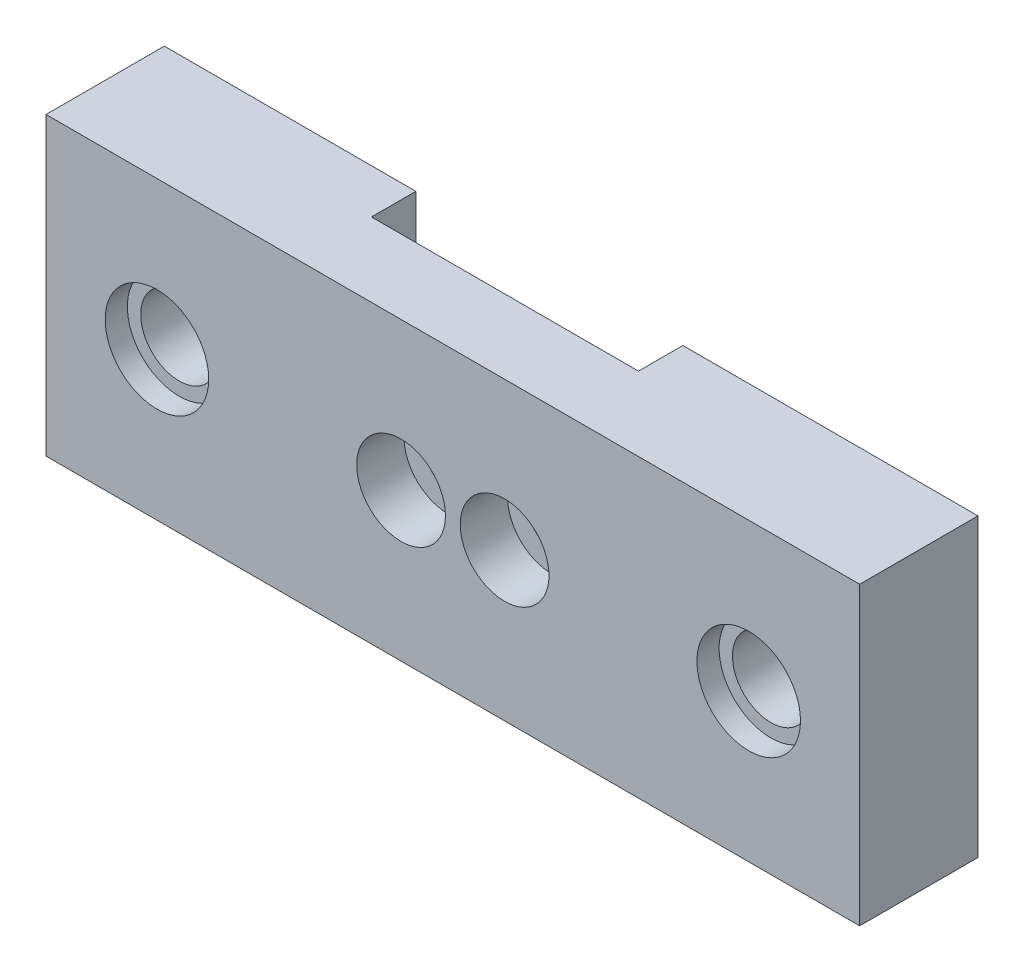
ISO-10303-21;
HEADER;
FILE_DESCRIPTION(('STEP AP214'),'2;1');
FILE_NAME('part.step','',(''),(''),'','','');
FILE_SCHEMA(('AUTOMOTIVE_DESIGN { 1 0 10303 214 1 1 1 1 }'));
ENDSEC;
DATA;
#1=APPLICATION_CONTEXT('core data for automotive mechanical design processes');
#2=APPLICATION_PROTOCOL_DEFINITION('international standard','automotive_design',2000,#1);
#3=PRODUCT_CONTEXT('',#1,'mechanical');
#4=PRODUCT('Part','Part','',(#3));
#5=PRODUCT_RELATED_PRODUCT_CATEGORY('part','',(#4));
#6=PRODUCT_DEFINITION_FORMATION('','',#4);
#7=PRODUCT_DEFINITION_CONTEXT('part definition',#1,'design');
#8=PRODUCT_DEFINITION('design','',#6,#7);
#9=PRODUCT_DEFINITION_SHAPE('','',#8);
#10=(LENGTH_UNIT() NAMED_UNIT(*) SI_UNIT(.MILLI.,.METRE.));
#11=(NAMED_UNIT(*) PLANE_ANGLE_UNIT() SI_UNIT($,.RADIAN.));
#12=(NAMED_UNIT(*) SI_UNIT($,.STERADIAN.) SOLID_ANGLE_UNIT());
#13=UNCERTAINTY_MEASURE_WITH_UNIT(LENGTH_MEASURE(1.E-05),#10,'distance_accuracy_value','');
#14=(GEOMETRIC_REPRESENTATION_CONTEXT(3) GLOBAL_UNCERTAINTY_ASSIGNED_CONTEXT((#13)) GLOBAL_UNIT_ASSIGNED_CONTEXT((#10,
#11,#12)) REPRESENTATION_CONTEXT('',''));
#15=CARTESIAN_POINT('',(0.,0.,0.));
#16=DIRECTION('',(0.,0.,1.));
#17=DIRECTION('',(1.,0.,0.));
#18=AXIS2_PLACEMENT_3D('',#15,#16,#17);
#19=CARTESIAN_POINT('',(3.5,0.,8.));
#20=DIRECTION('',(0.,0.,-1.));
#21=DIRECTION('',(-1.,0.,0.));
#22=AXIS2_PLACEMENT_3D('',#19,#20,#21);
#23=CYLINDRICAL_SURFACE('',#22,1.55);
#24=CARTESIAN_POINT('',(3.5,0.,4.8));
#25=DIRECTION('',(0.,0.,1.));
#26=DIRECTION('',(1.,0.,0.));
#27=AXIS2_PLACEMENT_3D('',#24,#25,#26);
#28=CIRCLE('',#27,1.55);
#29=CARTESIAN_POINT('',(5.05,0.,4.8));
#30=VERTEX_POINT('',#29);
#31=EDGE_CURVE('E31',#30,#30,#28,.T.);
#32=ORIENTED_EDGE('',*,*,#31,.T.);
#33=EDGE_LOOP('',(#32));
#34=FACE_BOUND('',#33,.T.);
#35=CARTESIAN_POINT('',(3.5,0.,3.));
#36=DIRECTION('',(0.,0.,-1.));
#37=DIRECTION('',(-1.,0.,0.));
#38=AXIS2_PLACEMENT_3D('',#35,#36,#37);
#39=CIRCLE('',#38,1.55);
#40=CARTESIAN_POINT('',(1.95,0.,3.));
#41=VERTEX_POINT('',#40);
#42=EDGE_CURVE('E141',#41,#41,#39,.F.);
#43=ORIENTED_EDGE('',*,*,#42,.F.);
#44=EDGE_LOOP('',(#43));
#45=FACE_BOUND('',#44,.T.);
#46=ADVANCED_FACE('F27',(#34,#45),#23,.F.);
#47=CARTESIAN_POINT('',(-3.5,0.,8.));
#48=DIRECTION('',(0.,0.,-1.));
#49=DIRECTION('',(-1.,0.,0.));
#50=AXIS2_PLACEMENT_3D('',#47,#48,#49);
#51=CYLINDRICAL_SURFACE('',#50,1.55);
#52=CARTESIAN_POINT('',(-3.5,0.,4.8));
#53=DIRECTION('',(0.,0.,1.));
#54=DIRECTION('',(1.,0.,0.));
#55=AXIS2_PLACEMENT_3D('',#52,#53,#54);
#56=CIRCLE('',#55,1.55);
#57=CARTESIAN_POINT('',(-1.95,0.,4.8));
#58=VERTEX_POINT('',#57);
#59=EDGE_CURVE('E178',#58,#58,#56,.T.);
#60=ORIENTED_EDGE('',*,*,#59,.T.);
#61=EDGE_LOOP('',(#60));
#62=FACE_BOUND('',#61,.T.);
#63=CARTESIAN_POINT('',(-3.5,0.,3.));
#64=DIRECTION('',(0.,0.,-1.));
#65=DIRECTION('',(-1.,0.,0.));
#66=AXIS2_PLACEMENT_3D('',#63,#64,#65);
#67=CIRCLE('',#66,1.55);
#68=CARTESIAN_POINT('',(-5.05,0.,3.));
#69=VERTEX_POINT('',#68);
#70=EDGE_CURVE('E138',#69,#69,#67,.F.);
#71=ORIENTED_EDGE('',*,*,#70,.F.);
#72=EDGE_LOOP('',(#71));
#73=FACE_BOUND('',#72,.T.);
#74=ADVANCED_FACE('F232',(#62,#73),#51,.F.);
#75=CARTESIAN_POINT('',(-27.5,-10.,0.));
#76=DIRECTION('',(0.,0.,1.));
#77=DIRECTION('',(1.,0.,0.));
#78=AXIS2_PLACEMENT_3D('',#75,#76,#77);
#79=PLANE('',#78);
#80=CARTESIAN_POINT('',(20.,0.,0.));
#81=DIRECTION('',(0.,0.,1.));
#82=DIRECTION('',(1.,0.,0.));
#83=AXIS2_PLACEMENT_3D('',#80,#81,#82);
#84=CIRCLE('',#83,2.6);
#85=CARTESIAN_POINT('',(22.6,0.,0.));
#86=VERTEX_POINT('',#85);
#87=EDGE_CURVE('E193',#86,#86,#84,.T.);
#88=ORIENTED_EDGE('',*,*,#87,.T.);
#89=EDGE_LOOP('',(#88));
#90=FACE_BOUND('',#89,.T.);
#91=DIRECTION('',(0.,1.,0.));
#92=VECTOR('',#91,1.);
#93=CARTESIAN_POINT('',(7.54999999999999,0.,0.));
#94=LINE('',#93,#92);
#95=CARTESIAN_POINT('',(7.54999999999999,-10.,0.));
#96=VERTEX_POINT('',#95);
#97=CARTESIAN_POINT('',(7.54999999999999,10.,0.));
#98=VERTEX_POINT('',#97);
#99=EDGE_CURVE('E133',#96,#98,#94,.T.);
#100=ORIENTED_EDGE('',*,*,#99,.T.);
#101=DIRECTION('',(-1.,0.,0.));
#102=VECTOR('',#101,1.);
#103=CARTESIAN_POINT('',(-27.5,10.,0.));
#104=LINE('',#103,#102);
#105=CARTESIAN_POINT('',(27.5,10.,0.));
#106=VERTEX_POINT('',#105);
#107=EDGE_CURVE('E208',#106,#98,#104,.T.);
#108=ORIENTED_EDGE('',*,*,#107,.F.);
#109=DIRECTION('',(0.,1.,0.));
#110=VECTOR('',#109,1.);
#111=CARTESIAN_POINT('',(27.5,10.,0.));
#112=LINE('',#111,#110);
#113=CARTESIAN_POINT('',(27.5,-10.,0.));
#114=VERTEX_POINT('',#113);
#115=EDGE_CURVE('E205',#114,#106,#112,.T.);
#116=ORIENTED_EDGE('',*,*,#115,.F.);
#117=DIRECTION('',(1.,0.,0.));
#118=VECTOR('',#117,1.);
#119=CARTESIAN_POINT('',(-27.5,-10.,0.));
#120=LINE('',#119,#118);
#121=EDGE_CURVE('E202',#96,#114,#120,.T.);
#122=ORIENTED_EDGE('',*,*,#121,.F.);
#123=EDGE_LOOP('',(#100,#108,#116,#122));
#124=FACE_BOUND('',#123,.T.);
#125=ADVANCED_FACE('F281',(#90,#124),#79,.F.);
#126=CARTESIAN_POINT('',(-27.5,10.,8.));
#127=DIRECTION('',(0.,-1.,0.));
#128=DIRECTION('',(1.,0.,0.));
#129=AXIS2_PLACEMENT_3D('',#126,#127,#128);
#130=PLANE('',#129);
#131=DIRECTION('',(0.,0.,-1.));
#132=VECTOR('',#131,1.);
#133=CARTESIAN_POINT('',(7.54999999999999,10.,3.));
#134=LINE('',#133,#132);
#135=CARTESIAN_POINT('',(7.54999999999999,10.,3.));
#136=VERTEX_POINT('',#135);
#137=EDGE_CURVE('E161',#136,#98,#134,.T.);
#138=ORIENTED_EDGE('',*,*,#137,.F.);
#139=DIRECTION('',(-1.,0.,0.));
#140=VECTOR('',#139,1.);
#141=CARTESIAN_POINT('',(-45.6620210886662,9.99999999999999,3.));
#142=LINE('',#141,#140);
#143=CARTESIAN_POINT('',(-10.5,10.,3.));
#144=VERTEX_POINT('',#143);
#145=EDGE_CURVE('E148',#136,#144,#142,.T.);
#146=ORIENTED_EDGE('',*,*,#145,.T.);
#147=DIRECTION('',(0.,0.,-1.));
#148=VECTOR('',#147,1.);
#149=CARTESIAN_POINT('',(-10.5,10.,3.));
#150=LINE('',#149,#148);
#151=CARTESIAN_POINT('',(-10.5,10.,0.));
#152=VERTEX_POINT('',#151);
#153=EDGE_CURVE('E163',#144,#152,#150,.T.);
#154=ORIENTED_EDGE('',*,*,#153,.T.);
#155=CARTESIAN_POINT('',(-27.5,10.,0.));
#156=VERTEX_POINT('',#155);
#157=EDGE_CURVE('E207',#152,#156,#104,.T.);
#158=ORIENTED_EDGE('',*,*,#157,.T.);
#159=DIRECTION('',(0.,0.,-1.));
#160=VECTOR('',#159,1.);
#161=CARTESIAN_POINT('',(-27.5,10.,8.));
#162=LINE('',#161,#160);
#163=CARTESIAN_POINT('',(-27.5,10.,8.));
#164=VERTEX_POINT('',#163);
#165=EDGE_CURVE('E218',#164,#156,#162,.T.);
#166=ORIENTED_EDGE('',*,*,#165,.F.);
#167=DIRECTION('',(-1.,0.,0.));
#168=VECTOR('',#167,1.);
#169=CARTESIAN_POINT('',(-27.5,10.,8.));
#170=LINE('',#169,#168);
#171=CARTESIAN_POINT('',(27.5,10.,8.));
#172=VERTEX_POINT('',#171);
#173=EDGE_CURVE('E52',#172,#164,#170,.T.);
#174=ORIENTED_EDGE('',*,*,#173,.F.);
#175=DIRECTION('',(0.,0.,-1.));
#176=VECTOR('',#175,1.);
#177=CARTESIAN_POINT('',(27.5,10.,8.));
#178=LINE('',#177,#176);
#179=EDGE_CURVE('E221',#172,#106,#178,.T.);
#180=ORIENTED_EDGE('',*,*,#179,.T.);
#181=ORIENTED_EDGE('',*,*,#107,.T.);
#182=EDGE_LOOP('',(#138,#146,#154,#158,#166,#174,#180,#181));
#183=FACE_BOUND('',#182,.T.);
#184=ADVANCED_FACE('F274',(#183),#130,.F.);
#185=CARTESIAN_POINT('',(20.,0.,8.));
#186=DIRECTION('',(0.,0.,-1.));
#187=DIRECTION('',(-1.,0.,0.));
#188=AXIS2_PLACEMENT_3D('',#185,#186,#187);
#189=CYLINDRICAL_SURFACE('',#188,2.6);
#190=ORIENTED_EDGE('',*,*,#87,.F.);
#191=EDGE_LOOP('',(#190));
#192=FACE_BOUND('',#191,.T.);
#193=CARTESIAN_POINT('',(20.,0.,6.5));
#194=DIRECTION('',(0.,0.,1.));
#195=DIRECTION('',(1.,0.,0.));
#196=AXIS2_PLACEMENT_3D('',#193,#194,#195);
#197=CIRCLE('',#196,2.6);
#198=CARTESIAN_POINT('',(22.6,0.,6.5));
#199=VERTEX_POINT('',#198);
#200=EDGE_CURVE('E185',#199,#199,#197,.T.);
#201=ORIENTED_EDGE('',*,*,#200,.T.);
#202=EDGE_LOOP('',(#201));
#203=FACE_BOUND('',#202,.T.);
#204=ADVANCED_FACE('F307',(#192,#203),#189,.F.);
#205=CARTESIAN_POINT('',(-20.,0.,8.));
#206=DIRECTION('',(0.,0.,-1.));
#207=DIRECTION('',(-1.,0.,0.));
#208=AXIS2_PLACEMENT_3D('',#205,#206,#207);
#209=CYLINDRICAL_SURFACE('',#208,2.6);
#210=CARTESIAN_POINT('',(-20.,0.,0.));
#211=DIRECTION('',(0.,0.,1.));
#212=DIRECTION('',(1.,0.,0.));
#213=AXIS2_PLACEMENT_3D('',#210,#211,#212);
#214=CIRCLE('',#213,2.6);
#215=CARTESIAN_POINT('',(-17.4,0.,0.));
#216=VERTEX_POINT('',#215);
#217=EDGE_CURVE('E196',#216,#216,#214,.T.);
#218=ORIENTED_EDGE('',*,*,#217,.F.);
#219=EDGE_LOOP('',(#218));
#220=FACE_BOUND('',#219,.T.);
#221=CARTESIAN_POINT('',(-20.,0.,6.5));
#222=DIRECTION('',(0.,0.,1.));
#223=DIRECTION('',(1.,0.,0.));
#224=AXIS2_PLACEMENT_3D('',#221,#222,#223);
#225=CIRCLE('',#224,2.6);
#226=CARTESIAN_POINT('',(-17.4,0.,6.5));
#227=VERTEX_POINT('',#226);
#228=EDGE_CURVE('E192',#227,#227,#225,.T.);
#229=ORIENTED_EDGE('',*,*,#228,.T.);
#230=EDGE_LOOP('',(#229));
#231=FACE_BOUND('',#230,.T.);
#232=ADVANCED_FACE('F252',(#220,#231),#209,.F.);
#233=CARTESIAN_POINT('',(-27.5,-10.,8.));
#234=DIRECTION('',(0.,0.,1.));
#235=DIRECTION('',(1.,0.,0.));
#236=AXIS2_PLACEMENT_3D('',#233,#234,#235);
#237=PLANE('',#236);
#238=CARTESIAN_POINT('',(3.5,0.,8.));
#239=DIRECTION('',(0.,0.,1.));
#240=DIRECTION('',(1.,0.,0.));
#241=AXIS2_PLACEMENT_3D('',#238,#239,#240);
#242=CIRCLE('',#241,3.);
#243=CARTESIAN_POINT('',(6.5,0.,8.));
#244=VERTEX_POINT('',#243);
#245=EDGE_CURVE('E157',#244,#244,#242,.T.);
#246=ORIENTED_EDGE('',*,*,#245,.F.);
#247=EDGE_LOOP('',(#246));
#248=FACE_BOUND('',#247,.T.);
#249=CARTESIAN_POINT('',(-3.5,0.,8.));
#250=DIRECTION('',(0.,0.,1.));
#251=DIRECTION('',(1.,0.,0.));
#252=AXIS2_PLACEMENT_3D('',#249,#250,#251);
#253=CIRCLE('',#252,3.);
#254=CARTESIAN_POINT('',(-0.499999999999998,0.,8.));
#255=VERTEX_POINT('',#254);
#256=EDGE_CURVE('E172',#255,#255,#253,.T.);
#257=ORIENTED_EDGE('',*,*,#256,.F.);
#258=EDGE_LOOP('',(#257));
#259=FACE_BOUND('',#258,.T.);
#260=CARTESIAN_POINT('',(20.,0.,8.));
#261=DIRECTION('',(0.,0.,1.));
#262=DIRECTION('',(1.,0.,0.));
#263=AXIS2_PLACEMENT_3D('',#260,#261,#262);
#264=CIRCLE('',#263,3.5);
#265=CARTESIAN_POINT('',(23.5,0.,8.));
#266=VERTEX_POINT('',#265);
#267=EDGE_CURVE('E179',#266,#266,#264,.T.);
#268=ORIENTED_EDGE('',*,*,#267,.F.);
#269=EDGE_LOOP('',(#268));
#270=FACE_BOUND('',#269,.T.);
#271=CARTESIAN_POINT('',(-20.,0.,8.));
#272=DIRECTION('',(0.,0.,1.));
#273=DIRECTION('',(1.,0.,0.));
#274=AXIS2_PLACEMENT_3D('',#271,#272,#273);
#275=CIRCLE('',#274,3.5);
#276=CARTESIAN_POINT('',(-16.5,0.,8.));
#277=VERTEX_POINT('',#276);
#278=EDGE_CURVE('E186',#277,#277,#275,.T.);
#279=ORIENTED_EDGE('',*,*,#278,.F.);
#280=EDGE_LOOP('',(#279));
#281=FACE_BOUND('',#280,.T.);
#282=DIRECTION('',(0.,-1.,0.));
#283=VECTOR('',#282,1.);
#284=CARTESIAN_POINT('',(-27.5,10.,8.));
#285=LINE('',#284,#283);
#286=CARTESIAN_POINT('',(-27.5,-10.,8.));
#287=VERTEX_POINT('',#286);
#288=EDGE_CURVE('E211',#164,#287,#285,.T.);
#289=ORIENTED_EDGE('',*,*,#288,.T.);
#290=DIRECTION('',(1.,0.,0.));
#291=VECTOR('',#290,1.);
#292=CARTESIAN_POINT('',(-27.5,-10.,8.));
#293=LINE('',#292,#291);
#294=CARTESIAN_POINT('',(27.5,-10.,8.));
#295=VERTEX_POINT('',#294);
#296=EDGE_CURVE('E213',#287,#295,#293,.T.);
#297=ORIENTED_EDGE('',*,*,#296,.T.);
#298=DIRECTION('',(0.,1.,0.));
#299=VECTOR('',#298,1.);
#300=CARTESIAN_POINT('',(27.5,10.,8.));
#301=LINE('',#300,#299);
#302=EDGE_CURVE('E215',#295,#172,#301,.T.);
#303=ORIENTED_EDGE('',*,*,#302,.T.);
#304=ORIENTED_EDGE('',*,*,#173,.T.);
#305=EDGE_LOOP('',(#289,#297,#303,#304));
#306=FACE_BOUND('',#305,.T.);
#307=ADVANCED_FACE('F249',(#248,#259,#270,#281,#306),#237,.T.);
#308=ORIENTED_EDGE('',*,*,#217,.T.);
#309=EDGE_LOOP('',(#308));
#310=FACE_BOUND('',#309,.T.);
#311=CARTESIAN_POINT('',(-7.5,6.,0.));
#312=DIRECTION('',(0.,0.,-1.));
#313=DIRECTION('',(-1.,0.,0.));
#314=AXIS2_PLACEMENT_3D('',#311,#312,#313);
#315=CIRCLE('',#314,3.);
#316=CARTESIAN_POINT('',(-7.55,3.00041669560588,0.));
#317=VERTEX_POINT('',#316);
#318=CARTESIAN_POINT('',(-10.5,6.,0.));
#319=VERTEX_POINT('',#318);
#320=EDGE_CURVE('E112',#317,#319,#315,.T.);
#321=ORIENTED_EDGE('',*,*,#320,.F.);
#322=DIRECTION('',(0.,1.,0.));
#323=VECTOR('',#322,1.);
#324=CARTESIAN_POINT('',(-7.54999999999999,0.,0.));
#325=LINE('',#324,#323);
#326=CARTESIAN_POINT('',(-7.54999999999999,-10.,0.));
#327=VERTEX_POINT('',#326);
#328=EDGE_CURVE('E122',#327,#317,#325,.T.);
#329=ORIENTED_EDGE('',*,*,#328,.F.);
#330=CARTESIAN_POINT('',(-27.5,-10.,0.));
#331=VERTEX_POINT('',#330);
#332=EDGE_CURVE('E203',#331,#327,#120,.T.);
#333=ORIENTED_EDGE('',*,*,#332,.F.);
#334=DIRECTION('',(0.,-1.,0.));
#335=VECTOR('',#334,1.);
#336=CARTESIAN_POINT('',(-27.5,10.,0.));
#337=LINE('',#336,#335);
#338=EDGE_CURVE('E199',#156,#331,#337,.T.);
#339=ORIENTED_EDGE('',*,*,#338,.F.);
#340=ORIENTED_EDGE('',*,*,#157,.F.);
#341=DIRECTION('',(0.,1.,0.));
#342=VECTOR('',#341,1.);
#343=CARTESIAN_POINT('',(-10.5,0.,0.));
#344=LINE('',#343,#342);
#345=EDGE_CURVE('E131',#319,#152,#344,.T.);
#346=ORIENTED_EDGE('',*,*,#345,.F.);
#347=EDGE_LOOP('',(#321,#329,#333,#339,#340,#346));
#348=FACE_BOUND('',#347,.T.);
#349=ADVANCED_FACE('F129',(#310,#348),#79,.F.);
#350=CARTESIAN_POINT('',(-27.5,10.,8.));
#351=DIRECTION('',(1.,0.,0.));
#352=DIRECTION('',(0.,1.,0.));
#353=AXIS2_PLACEMENT_3D('',#350,#351,#352);
#354=PLANE('',#353);
#355=ORIENTED_EDGE('',*,*,#338,.T.);
#356=DIRECTION('',(0.,0.,-1.));
#357=VECTOR('',#356,1.);
#358=CARTESIAN_POINT('',(-27.5,-10.,8.));
#359=LINE('',#358,#357);
#360=EDGE_CURVE('E11',#287,#331,#359,.T.);
#361=ORIENTED_EDGE('',*,*,#360,.F.);
#362=ORIENTED_EDGE('',*,*,#288,.F.);
#363=ORIENTED_EDGE('',*,*,#165,.T.);
#364=EDGE_LOOP('',(#355,#361,#362,#363));
#365=FACE_BOUND('',#364,.T.);
#366=ADVANCED_FACE('F29',(#365),#354,.F.);
#367=CARTESIAN_POINT('',(-27.5,-10.,8.));
#368=DIRECTION('',(0.,1.,0.));
#369=DIRECTION('',(-1.,0.,0.));
#370=AXIS2_PLACEMENT_3D('',#367,#368,#369);
#371=PLANE('',#370);
#372=ORIENTED_EDGE('',*,*,#332,.T.);
#373=DIRECTION('',(0.,0.,-1.));
#374=VECTOR('',#373,1.);
#375=CARTESIAN_POINT('',(-7.54999999999999,-10.,3.));
#376=LINE('',#375,#374);
#377=CARTESIAN_POINT('',(-7.54999999999999,-10.,3.));
#378=VERTEX_POINT('',#377);
#379=EDGE_CURVE('E125',#378,#327,#376,.T.);
#380=ORIENTED_EDGE('',*,*,#379,.F.);
#381=DIRECTION('',(1.,0.,0.));
#382=VECTOR('',#381,1.);
#383=CARTESIAN_POINT('',(-45.6620210886662,-10.,3.));
#384=LINE('',#383,#382);
#385=CARTESIAN_POINT('',(7.54999999999999,-10.,3.));
#386=VERTEX_POINT('',#385);
#387=EDGE_CURVE('E119',#378,#386,#384,.T.);
#388=ORIENTED_EDGE('',*,*,#387,.T.);
#389=DIRECTION('',(0.,0.,-1.));
#390=VECTOR('',#389,1.);
#391=CARTESIAN_POINT('',(7.54999999999999,-10.,3.));
#392=LINE('',#391,#390);
#393=EDGE_CURVE('E158',#386,#96,#392,.T.);
#394=ORIENTED_EDGE('',*,*,#393,.T.);
#395=ORIENTED_EDGE('',*,*,#121,.T.);
#396=DIRECTION('',(0.,0.,-1.));
#397=VECTOR('',#396,1.);
#398=CARTESIAN_POINT('',(27.5,-10.,8.));
#399=LINE('',#398,#397);
#400=EDGE_CURVE('E36',#295,#114,#399,.T.);
#401=ORIENTED_EDGE('',*,*,#400,.F.);
#402=ORIENTED_EDGE('',*,*,#296,.F.);
#403=ORIENTED_EDGE('',*,*,#360,.T.);
#404=EDGE_LOOP('',(#372,#380,#388,#394,#395,#401,#402,#403));
#405=FACE_BOUND('',#404,.T.);
#406=ADVANCED_FACE('F264',(#405),#371,.F.);
#407=CARTESIAN_POINT('',(27.5,10.,8.));
#408=DIRECTION('',(-1.,0.,0.));
#409=DIRECTION('',(0.,-1.,0.));
#410=AXIS2_PLACEMENT_3D('',#407,#408,#409);
#411=PLANE('',#410);
#412=ORIENTED_EDGE('',*,*,#115,.T.);
#413=ORIENTED_EDGE('',*,*,#179,.F.);
#414=ORIENTED_EDGE('',*,*,#302,.F.);
#415=ORIENTED_EDGE('',*,*,#400,.T.);
#416=EDGE_LOOP('',(#412,#413,#414,#415));
#417=FACE_BOUND('',#416,.T.);
#418=ADVANCED_FACE('F270',(#417),#411,.F.);
#419=CARTESIAN_POINT('',(-20.,0.,6.5));
#420=DIRECTION('',(0.,0.,1.));
#421=DIRECTION('',(1.,0.,0.));
#422=AXIS2_PLACEMENT_3D('',#419,#420,#421);
#423=CYLINDRICAL_SURFACE('',#422,3.5);
#424=CARTESIAN_POINT('',(-20.,0.,6.5));
#425=DIRECTION('',(0.,0.,1.));
#426=DIRECTION('',(1.,0.,0.));
#427=AXIS2_PLACEMENT_3D('',#424,#425,#426);
#428=CIRCLE('',#427,3.5);
#429=CARTESIAN_POINT('',(-16.5,0.,6.5));
#430=VERTEX_POINT('',#429);
#431=EDGE_CURVE('E189',#430,#430,#428,.T.);
#432=ORIENTED_EDGE('',*,*,#431,.F.);
#433=EDGE_LOOP('',(#432));
#434=FACE_BOUND('',#433,.T.);
#435=ORIENTED_EDGE('',*,*,#278,.T.);
#436=EDGE_LOOP('',(#435));
#437=FACE_BOUND('',#436,.T.);
#438=ADVANCED_FACE('F304',(#434,#437),#423,.F.);
#439=CARTESIAN_POINT('',(-20.,0.,6.5));
#440=DIRECTION('',(0.,0.,1.));
#441=DIRECTION('',(1.,0.,0.));
#442=AXIS2_PLACEMENT_3D('',#439,#440,#441);
#443=PLANE('',#442);
#444=ORIENTED_EDGE('',*,*,#228,.F.);
#445=EDGE_LOOP('',(#444));
#446=FACE_BOUND('',#445,.T.);
#447=ORIENTED_EDGE('',*,*,#431,.T.);
#448=EDGE_LOOP('',(#447));
#449=FACE_BOUND('',#448,.T.);
#450=ADVANCED_FACE('F345',(#446,#449),#443,.T.);
#451=CARTESIAN_POINT('',(20.,0.,6.5));
#452=DIRECTION('',(0.,0.,1.));
#453=DIRECTION('',(1.,0.,0.));
#454=AXIS2_PLACEMENT_3D('',#451,#452,#453);
#455=CYLINDRICAL_SURFACE('',#454,3.5);
#456=CARTESIAN_POINT('',(20.,0.,6.5));
#457=DIRECTION('',(0.,0.,1.));
#458=DIRECTION('',(1.,0.,0.));
#459=AXIS2_PLACEMENT_3D('',#456,#457,#458);
#460=CIRCLE('',#459,3.5);
#461=CARTESIAN_POINT('',(23.5,0.,6.5));
#462=VERTEX_POINT('',#461);
#463=EDGE_CURVE('E182',#462,#462,#460,.T.);
#464=ORIENTED_EDGE('',*,*,#463,.F.);
#465=EDGE_LOOP('',(#464));
#466=FACE_BOUND('',#465,.T.);
#467=ORIENTED_EDGE('',*,*,#267,.T.);
#468=EDGE_LOOP('',(#467));
#469=FACE_BOUND('',#468,.T.);
#470=ADVANCED_FACE('F352',(#466,#469),#455,.F.);
#471=CARTESIAN_POINT('',(20.,0.,6.5));
#472=DIRECTION('',(0.,0.,1.));
#473=DIRECTION('',(1.,0.,0.));
#474=AXIS2_PLACEMENT_3D('',#471,#472,#473);
#475=PLANE('',#474);
#476=ORIENTED_EDGE('',*,*,#200,.F.);
#477=EDGE_LOOP('',(#476));
#478=FACE_BOUND('',#477,.T.);
#479=ORIENTED_EDGE('',*,*,#463,.T.);
#480=EDGE_LOOP('',(#479));
#481=FACE_BOUND('',#480,.T.);
#482=ADVANCED_FACE('F245',(#478,#481),#475,.T.);
#483=CARTESIAN_POINT('',(-3.5,0.,4.8));
#484=DIRECTION('',(0.,0.,1.));
#485=DIRECTION('',(1.,0.,0.));
#486=AXIS2_PLACEMENT_3D('',#483,#484,#485);
#487=CYLINDRICAL_SURFACE('',#486,3.);
#488=CARTESIAN_POINT('',(-3.5,0.,4.8));
#489=DIRECTION('',(0.,0.,1.));
#490=DIRECTION('',(1.,0.,0.));
#491=AXIS2_PLACEMENT_3D('',#488,#489,#490);
#492=CIRCLE('',#491,3.);
#493=CARTESIAN_POINT('',(-0.499999999999998,0.,4.8));
#494=VERTEX_POINT('',#493);
#495=EDGE_CURVE('E175',#494,#494,#492,.T.);
#496=ORIENTED_EDGE('',*,*,#495,.F.);
#497=EDGE_LOOP('',(#496));
#498=FACE_BOUND('',#497,.T.);
#499=ORIENTED_EDGE('',*,*,#256,.T.);
#500=EDGE_LOOP('',(#499));
#501=FACE_BOUND('',#500,.T.);
#502=ADVANCED_FACE('F239',(#498,#501),#487,.F.);
#503=CARTESIAN_POINT('',(-3.5,0.,4.8));
#504=DIRECTION('',(0.,0.,1.));
#505=DIRECTION('',(1.,0.,0.));
#506=AXIS2_PLACEMENT_3D('',#503,#504,#505);
#507=PLANE('',#506);
#508=ORIENTED_EDGE('',*,*,#59,.F.);
#509=EDGE_LOOP('',(#508));
#510=FACE_BOUND('',#509,.T.);
#511=ORIENTED_EDGE('',*,*,#495,.T.);
#512=EDGE_LOOP('',(#511));
#513=FACE_BOUND('',#512,.T.);
#514=ADVANCED_FACE('F235',(#510,#513),#507,.T.);
#515=CARTESIAN_POINT('',(3.5,0.,4.8));
#516=DIRECTION('',(0.,0.,1.));
#517=DIRECTION('',(1.,0.,0.));
#518=AXIS2_PLACEMENT_3D('',#515,#516,#517);
#519=CYLINDRICAL_SURFACE('',#518,3.);
#520=CARTESIAN_POINT('',(3.5,0.,4.8));
#521=DIRECTION('',(0.,0.,1.));
#522=DIRECTION('',(1.,0.,0.));
#523=AXIS2_PLACEMENT_3D('',#520,#521,#522);
#524=CIRCLE('',#523,3.);
#525=CARTESIAN_POINT('',(6.5,0.,4.8));
#526=VERTEX_POINT('',#525);
#527=EDGE_CURVE('E169',#526,#526,#524,.T.);
#528=ORIENTED_EDGE('',*,*,#527,.F.);
#529=EDGE_LOOP('',(#528));
#530=FACE_BOUND('',#529,.T.);
#531=ORIENTED_EDGE('',*,*,#245,.T.);
#532=EDGE_LOOP('',(#531));
#533=FACE_BOUND('',#532,.T.);
#534=ADVANCED_FACE('F238',(#530,#533),#519,.F.);
#535=CARTESIAN_POINT('',(3.5,0.,4.8));
#536=DIRECTION('',(0.,0.,1.));
#537=DIRECTION('',(1.,0.,0.));
#538=AXIS2_PLACEMENT_3D('',#535,#536,#537);
#539=PLANE('',#538);
#540=ORIENTED_EDGE('',*,*,#31,.F.);
#541=EDGE_LOOP('',(#540));
#542=FACE_BOUND('',#541,.T.);
#543=ORIENTED_EDGE('',*,*,#527,.T.);
#544=EDGE_LOOP('',(#543));
#545=FACE_BOUND('',#544,.T.);
#546=ADVANCED_FACE('F290',(#542,#545),#539,.T.);
#547=CARTESIAN_POINT('',(-7.54999999999999,0.,3.));
#548=DIRECTION('',(-1.,0.,0.));
#549=DIRECTION('',(0.,-1.,0.));
#550=AXIS2_PLACEMENT_3D('',#547,#548,#549);
#551=PLANE('',#550);
#552=ORIENTED_EDGE('',*,*,#328,.T.);
#553=DIRECTION('',(0.,0.,-1.));
#554=VECTOR('',#553,1.);
#555=CARTESIAN_POINT('',(-7.55,3.00041669560588,3.));
#556=LINE('',#555,#554);
#557=CARTESIAN_POINT('',(-7.55,3.00041669560588,3.));
#558=VERTEX_POINT('',#557);
#559=EDGE_CURVE('E108',#558,#317,#556,.T.);
#560=ORIENTED_EDGE('',*,*,#559,.F.);
#561=DIRECTION('',(0.,1.,0.));
#562=VECTOR('',#561,1.);
#563=CARTESIAN_POINT('',(-7.54999999999999,0.,3.));
#564=LINE('',#563,#562);
#565=EDGE_CURVE('E144',#378,#558,#564,.T.);
#566=ORIENTED_EDGE('',*,*,#565,.F.);
#567=ORIENTED_EDGE('',*,*,#379,.T.);
#568=EDGE_LOOP('',(#552,#560,#566,#567));
#569=FACE_BOUND('',#568,.T.);
#570=ADVANCED_FACE('F123',(#569),#551,.F.);
#571=CARTESIAN_POINT('',(7.54999999999999,0.,3.));
#572=DIRECTION('',(-1.,0.,0.));
#573=DIRECTION('',(0.,-1.,0.));
#574=AXIS2_PLACEMENT_3D('',#571,#572,#573);
#575=PLANE('',#574);
#576=ORIENTED_EDGE('',*,*,#99,.F.);
#577=ORIENTED_EDGE('',*,*,#393,.F.);
#578=DIRECTION('',(0.,1.,0.));
#579=VECTOR('',#578,1.);
#580=CARTESIAN_POINT('',(7.54999999999999,0.,3.));
#581=LINE('',#580,#579);
#582=EDGE_CURVE('E151',#386,#136,#581,.T.);
#583=ORIENTED_EDGE('',*,*,#582,.T.);
#584=ORIENTED_EDGE('',*,*,#137,.T.);
#585=EDGE_LOOP('',(#576,#577,#583,#584));
#586=FACE_BOUND('',#585,.T.);
#587=ADVANCED_FACE('F282',(#586),#575,.T.);
#588=CARTESIAN_POINT('',(-10.5,0.,3.));
#589=DIRECTION('',(-1.,0.,0.));
#590=DIRECTION('',(0.,-1.,0.));
#591=AXIS2_PLACEMENT_3D('',#588,#589,#590);
#592=PLANE('',#591);
#593=ORIENTED_EDGE('',*,*,#345,.T.);
#594=ORIENTED_EDGE('',*,*,#153,.F.);
#595=DIRECTION('',(0.,1.,0.));
#596=VECTOR('',#595,1.);
#597=CARTESIAN_POINT('',(-10.5,0.,3.));
#598=LINE('',#597,#596);
#599=CARTESIAN_POINT('',(-10.5,6.,3.));
#600=VERTEX_POINT('',#599);
#601=EDGE_CURVE('E44',#600,#144,#598,.T.);
#602=ORIENTED_EDGE('',*,*,#601,.F.);
#603=DIRECTION('',(0.,0.,-1.));
#604=VECTOR('',#603,1.);
#605=CARTESIAN_POINT('',(-10.5,6.,3.));
#606=LINE('',#605,#604);
#607=EDGE_CURVE('E118',#600,#319,#606,.T.);
#608=ORIENTED_EDGE('',*,*,#607,.T.);
#609=EDGE_LOOP('',(#593,#594,#602,#608));
#610=FACE_BOUND('',#609,.T.);
#611=ADVANCED_FACE('F276',(#610),#592,.F.);
#612=CARTESIAN_POINT('',(-7.5,6.,3.));
#613=DIRECTION('',(0.,0.,-1.));
#614=DIRECTION('',(-1.,0.,0.));
#615=AXIS2_PLACEMENT_3D('',#612,#613,#614);
#616=CYLINDRICAL_SURFACE('',#615,3.);
#617=ORIENTED_EDGE('',*,*,#320,.T.);
#618=ORIENTED_EDGE('',*,*,#607,.F.);
#619=CARTESIAN_POINT('',(-7.5,6.,3.));
#620=DIRECTION('',(0.,0.,-1.));
#621=DIRECTION('',(-1.,0.,0.));
#622=AXIS2_PLACEMENT_3D('',#619,#620,#621);
#623=CIRCLE('',#622,3.);
#624=EDGE_CURVE('E114',#558,#600,#623,.T.);
#625=ORIENTED_EDGE('',*,*,#624,.F.);
#626=ORIENTED_EDGE('',*,*,#559,.T.);
#627=EDGE_LOOP('',(#617,#618,#625,#626));
#628=FACE_BOUND('',#627,.T.);
#629=ADVANCED_FACE('F110',(#628),#616,.F.);
#630=CARTESIAN_POINT('',(-45.6620210886662,0.,3.));
#631=DIRECTION('',(0.,0.,-1.));
#632=DIRECTION('',(-1.,0.,0.));
#633=AXIS2_PLACEMENT_3D('',#630,#631,#632);
#634=PLANE('',#633);
#635=ORIENTED_EDGE('',*,*,#70,.T.);
#636=EDGE_LOOP('',(#635));
#637=FACE_BOUND('',#636,.T.);
#638=ORIENTED_EDGE('',*,*,#42,.T.);
#639=EDGE_LOOP('',(#638));
#640=FACE_BOUND('',#639,.T.);
#641=ORIENTED_EDGE('',*,*,#565,.T.);
#642=ORIENTED_EDGE('',*,*,#624,.T.);
#643=ORIENTED_EDGE('',*,*,#601,.T.);
#644=ORIENTED_EDGE('',*,*,#145,.F.);
#645=ORIENTED_EDGE('',*,*,#582,.F.);
#646=ORIENTED_EDGE('',*,*,#387,.F.);
#647=EDGE_LOOP('',(#641,#642,#643,#644,#645,#646));
#648=FACE_BOUND('',#647,.T.);
#649=ADVANCED_FACE('F277',(#637,#640,#648),#634,.T.);
#650=CLOSED_SHELL('',(#46,#74,#125,#184,#204,#232,#307,#349,#366,#406,#418,#438,#450,#470,#482,
#502,#514,#534,#546,#570,#587,#611,#629,#649));
#651=MANIFOLD_SOLID_BREP('B2',#650);
#652=ADVANCED_BREP_SHAPE_REPRESENTATION('',(#18,#651),#14);
#653=SHAPE_DEFINITION_REPRESENTATION(#9,#652);
ENDSEC;
END-ISO-10303-21;
